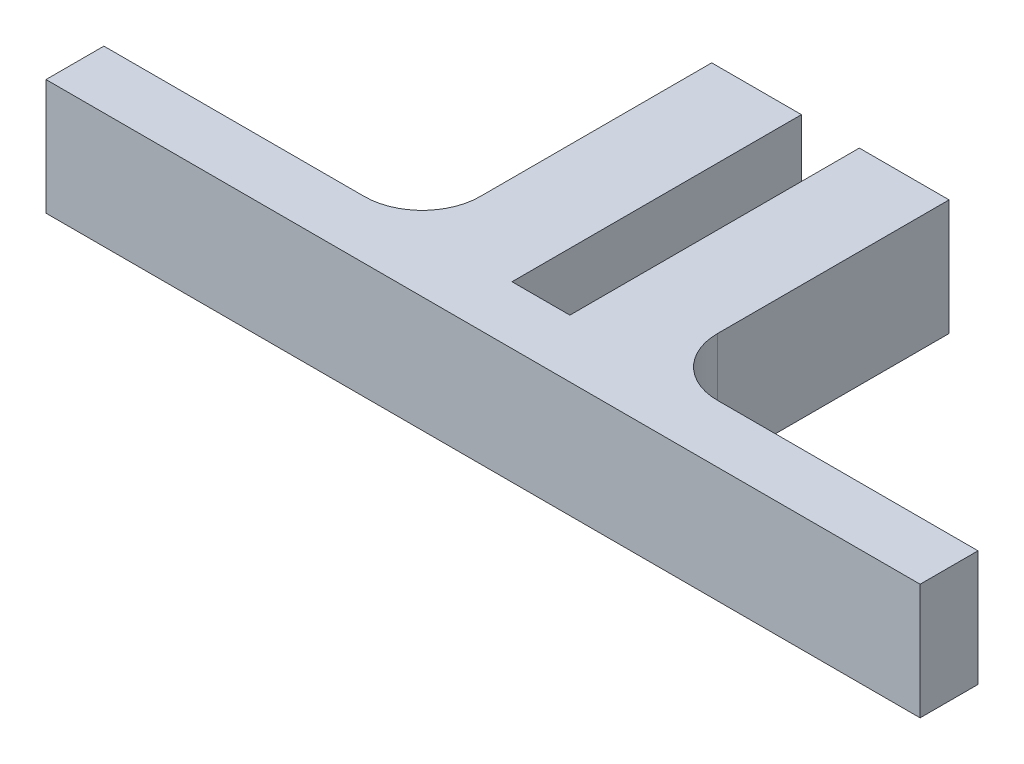
ISO-10303-21;
HEADER;
FILE_DESCRIPTION(('STEP AP214'),'2;1');
FILE_NAME('part.step','',(''),(''),'','','');
FILE_SCHEMA(('AUTOMOTIVE_DESIGN { 1 0 10303 214 1 1 1 1 }'));
ENDSEC;
DATA;
#1=APPLICATION_CONTEXT('core data for automotive mechanical design processes');
#2=APPLICATION_PROTOCOL_DEFINITION('international standard','automotive_design',2000,#1);
#3=PRODUCT_CONTEXT('',#1,'mechanical');
#4=PRODUCT('Part','Part','',(#3));
#5=PRODUCT_RELATED_PRODUCT_CATEGORY('part','',(#4));
#6=PRODUCT_DEFINITION_FORMATION('','',#4);
#7=PRODUCT_DEFINITION_CONTEXT('part definition',#1,'design');
#8=PRODUCT_DEFINITION('design','',#6,#7);
#9=PRODUCT_DEFINITION_SHAPE('','',#8);
#10=(LENGTH_UNIT() NAMED_UNIT(*) SI_UNIT(.MILLI.,.METRE.));
#11=(NAMED_UNIT(*) PLANE_ANGLE_UNIT() SI_UNIT($,.RADIAN.));
#12=(NAMED_UNIT(*) SI_UNIT($,.STERADIAN.) SOLID_ANGLE_UNIT());
#13=UNCERTAINTY_MEASURE_WITH_UNIT(LENGTH_MEASURE(1.E-05),#10,'distance_accuracy_value','');
#14=(GEOMETRIC_REPRESENTATION_CONTEXT(3) GLOBAL_UNCERTAINTY_ASSIGNED_CONTEXT((#13)) GLOBAL_UNIT_ASSIGNED_CONTEXT((#10,
#11,#12)) REPRESENTATION_CONTEXT('',''));
#15=CARTESIAN_POINT('',(0.,0.,0.));
#16=DIRECTION('',(0.,0.,1.));
#17=DIRECTION('',(1.,0.,0.));
#18=AXIS2_PLACEMENT_3D('',#15,#16,#17);
#19=CARTESIAN_POINT('',(15.3033459104335,20.,-102.020345879892));
#20=DIRECTION('',(0.,0.,1.));
#21=DIRECTION('',(1.,0.,0.));
#22=AXIS2_PLACEMENT_3D('',#19,#20,#21);
#23=PLANE('',#22);
#24=DIRECTION('',(0.,1.,0.));
#25=VECTOR('',#24,1.);
#26=CARTESIAN_POINT('',(-0.196654089566506,0.,-102.020345879892));
#27=LINE('',#26,#25);
#28=CARTESIAN_POINT('',(-0.196654089566506,0.,-102.020345879892));
#29=VERTEX_POINT('',#28);
#30=CARTESIAN_POINT('',(-0.196654089566506,20.,-102.020345879892));
#31=VERTEX_POINT('',#30);
#32=EDGE_CURVE('E272',#29,#31,#27,.T.);
#33=ORIENTED_EDGE('',*,*,#32,.T.);
#34=DIRECTION('',(-1.,0.,0.));
#35=VECTOR('',#34,1.);
#36=CARTESIAN_POINT('',(15.3033459104335,20.,-102.020345879892));
#37=LINE('',#36,#35);
#38=CARTESIAN_POINT('',(15.3033459104335,20.,-102.020345879892));
#39=VERTEX_POINT('',#38);
#40=EDGE_CURVE('E147',#39,#31,#37,.T.);
#41=ORIENTED_EDGE('',*,*,#40,.F.);
#42=DIRECTION('',(0.,-1.,0.));
#43=VECTOR('',#42,1.);
#44=CARTESIAN_POINT('',(15.3033459104335,20.,-102.020345879892));
#45=LINE('',#44,#43);
#46=CARTESIAN_POINT('',(15.3033459104335,0.,-102.020345879892));
#47=VERTEX_POINT('',#46);
#48=EDGE_CURVE('E207',#39,#47,#45,.T.);
#49=ORIENTED_EDGE('',*,*,#48,.T.);
#50=DIRECTION('',(-1.,0.,0.));
#51=VECTOR('',#50,1.);
#52=CARTESIAN_POINT('',(15.3033459104335,0.,-102.020345879892));
#53=LINE('',#52,#51);
#54=EDGE_CURVE('E189',#47,#29,#53,.T.);
#55=ORIENTED_EDGE('',*,*,#54,.T.);
#56=EDGE_LOOP('',(#33,#41,#49,#55));
#57=FACE_BOUND('',#56,.T.);
#58=ADVANCED_FACE('F39',(#57),#23,.F.);
#59=CARTESIAN_POINT('',(-80.6966540895665,20.,-52.0203458798924));
#60=DIRECTION('',(1.,0.,0.));
#61=DIRECTION('',(0.,0.,-1.));
#62=AXIS2_PLACEMENT_3D('',#59,#60,#61);
#63=PLANE('',#62);
#64=DIRECTION('',(0.,0.,1.));
#65=VECTOR('',#64,1.);
#66=CARTESIAN_POINT('',(-80.6966540895665,0.,-52.0203458798924));
#67=LINE('',#66,#65);
#68=CARTESIAN_POINT('',(-80.6966540895665,0.,-52.0203458798924));
#69=VERTEX_POINT('',#68);
#70=CARTESIAN_POINT('',(-80.6966540895665,0.,-42.0203458798924));
#71=VERTEX_POINT('',#70);
#72=EDGE_CURVE('E168',#69,#71,#67,.T.);
#73=ORIENTED_EDGE('',*,*,#72,.T.);
#74=DIRECTION('',(0.,-1.,0.));
#75=VECTOR('',#74,1.);
#76=CARTESIAN_POINT('',(-80.6966540895665,20.,-42.0203458798924));
#77=LINE('',#76,#75);
#78=CARTESIAN_POINT('',(-80.6966540895665,20.,-42.0203458798924));
#79=VERTEX_POINT('',#78);
#80=EDGE_CURVE('E11',#79,#71,#77,.T.);
#81=ORIENTED_EDGE('',*,*,#80,.F.);
#82=DIRECTION('',(0.,0.,1.));
#83=VECTOR('',#82,1.);
#84=CARTESIAN_POINT('',(-80.6966540895665,20.,-52.0203458798924));
#85=LINE('',#84,#83);
#86=CARTESIAN_POINT('',(-80.6966540895665,20.,-52.0203458798924));
#87=VERTEX_POINT('',#86);
#88=EDGE_CURVE('E200',#87,#79,#85,.T.);
#89=ORIENTED_EDGE('',*,*,#88,.F.);
#90=DIRECTION('',(0.,-1.,0.));
#91=VECTOR('',#90,1.);
#92=CARTESIAN_POINT('',(-80.6966540895665,20.,-52.0203458798924));
#93=LINE('',#92,#91);
#94=EDGE_CURVE('E164',#87,#69,#93,.T.);
#95=ORIENTED_EDGE('',*,*,#94,.T.);
#96=EDGE_LOOP('',(#73,#81,#89,#95));
#97=FACE_BOUND('',#96,.T.);
#98=ADVANCED_FACE('F41',(#97),#63,.F.);
#99=CARTESIAN_POINT('',(-80.6966540895665,20.,-42.0203458798924));
#100=DIRECTION('',(0.,0.,-1.));
#101=DIRECTION('',(-1.,0.,0.));
#102=AXIS2_PLACEMENT_3D('',#99,#100,#101);
#103=PLANE('',#102);
#104=DIRECTION('',(1.,0.,0.));
#105=VECTOR('',#104,1.);
#106=CARTESIAN_POINT('',(-80.6966540895665,0.,-42.0203458798924));
#107=LINE('',#106,#105);
#108=CARTESIAN_POINT('',(70.3033459104335,0.,-42.0203458798924));
#109=VERTEX_POINT('',#108);
#110=EDGE_CURVE('E172',#71,#109,#107,.T.);
#111=ORIENTED_EDGE('',*,*,#110,.T.);
#112=DIRECTION('',(0.,-1.,0.));
#113=VECTOR('',#112,1.);
#114=CARTESIAN_POINT('',(70.3033459104335,20.,-42.0203458798924));
#115=LINE('',#114,#113);
#116=CARTESIAN_POINT('',(70.3033459104335,20.,-42.0203458798924));
#117=VERTEX_POINT('',#116);
#118=EDGE_CURVE('E48',#117,#109,#115,.T.);
#119=ORIENTED_EDGE('',*,*,#118,.F.);
#120=DIRECTION('',(1.,0.,0.));
#121=VECTOR('',#120,1.);
#122=CARTESIAN_POINT('',(-80.6966540895665,20.,-42.0203458798924));
#123=LINE('',#122,#121);
#124=EDGE_CURVE('E111',#79,#117,#123,.T.);
#125=ORIENTED_EDGE('',*,*,#124,.F.);
#126=ORIENTED_EDGE('',*,*,#80,.T.);
#127=EDGE_LOOP('',(#111,#119,#125,#126));
#128=FACE_BOUND('',#127,.T.);
#129=ADVANCED_FACE('F304',(#128),#103,.F.);
#130=CARTESIAN_POINT('',(70.3033459104335,20.,-52.0203458798924));
#131=DIRECTION('',(-1.,0.,0.));
#132=DIRECTION('',(0.,0.,1.));
#133=AXIS2_PLACEMENT_3D('',#130,#131,#132);
#134=PLANE('',#133);
#135=DIRECTION('',(0.,0.,-1.));
#136=VECTOR('',#135,1.);
#137=CARTESIAN_POINT('',(70.3033459104335,0.,-52.0203458798924));
#138=LINE('',#137,#136);
#139=CARTESIAN_POINT('',(70.3033459104335,0.,-52.0203458798924));
#140=VERTEX_POINT('',#139);
#141=EDGE_CURVE('E176',#109,#140,#138,.T.);
#142=ORIENTED_EDGE('',*,*,#141,.T.);
#143=DIRECTION('',(0.,-1.,0.));
#144=VECTOR('',#143,1.);
#145=CARTESIAN_POINT('',(70.3033459104335,20.,-52.0203458798924));
#146=LINE('',#145,#144);
#147=CARTESIAN_POINT('',(70.3033459104335,20.,-52.0203458798924));
#148=VERTEX_POINT('',#147);
#149=EDGE_CURVE('E219',#148,#140,#146,.T.);
#150=ORIENTED_EDGE('',*,*,#149,.F.);
#151=DIRECTION('',(0.,0.,-1.));
#152=VECTOR('',#151,1.);
#153=CARTESIAN_POINT('',(70.3033459104335,20.,-52.0203458798924));
#154=LINE('',#153,#152);
#155=EDGE_CURVE('E229',#117,#148,#154,.T.);
#156=ORIENTED_EDGE('',*,*,#155,.F.);
#157=ORIENTED_EDGE('',*,*,#118,.T.);
#158=EDGE_LOOP('',(#142,#150,#156,#157));
#159=FACE_BOUND('',#158,.T.);
#160=ADVANCED_FACE('F227',(#159),#134,.F.);
#161=CARTESIAN_POINT('',(25.3033459104336,20.,-52.0203458798924));
#162=DIRECTION('',(0.,0.,1.));
#163=DIRECTION('',(1.,0.,0.));
#164=AXIS2_PLACEMENT_3D('',#161,#162,#163);
#165=PLANE('',#164);
#166=DIRECTION('',(-1.,0.,0.));
#167=VECTOR('',#166,1.);
#168=CARTESIAN_POINT('',(25.3033459104336,0.,-52.0203458798924));
#169=LINE('',#168,#167);
#170=CARTESIAN_POINT('',(25.3033459104336,0.,-52.0203458798924));
#171=VERTEX_POINT('',#170);
#172=EDGE_CURVE('E179',#140,#171,#169,.T.);
#173=ORIENTED_EDGE('',*,*,#172,.T.);
#174=DIRECTION('',(0.,-1.,0.));
#175=VECTOR('',#174,1.);
#176=CARTESIAN_POINT('',(25.3033459104336,20.,-52.0203458798924));
#177=LINE('',#176,#175);
#178=CARTESIAN_POINT('',(25.3033459104336,20.,-52.0203458798924));
#179=VERTEX_POINT('',#178);
#180=EDGE_CURVE('E215',#179,#171,#177,.T.);
#181=ORIENTED_EDGE('',*,*,#180,.F.);
#182=DIRECTION('',(-1.,0.,0.));
#183=VECTOR('',#182,1.);
#184=CARTESIAN_POINT('',(25.3033459104336,20.,-52.0203458798924));
#185=LINE('',#184,#183);
#186=EDGE_CURVE('E249',#148,#179,#185,.T.);
#187=ORIENTED_EDGE('',*,*,#186,.F.);
#188=ORIENTED_EDGE('',*,*,#149,.T.);
#189=EDGE_LOOP('',(#173,#181,#187,#188));
#190=FACE_BOUND('',#189,.T.);
#191=ADVANCED_FACE('F239',(#190),#165,.F.);
#192=CARTESIAN_POINT('',(25.3033459104335,20.,-62.0203458798924));
#193=DIRECTION('',(0.,-1.,0.));
#194=DIRECTION('',(0.,0.,-1.));
#195=AXIS2_PLACEMENT_3D('',#192,#193,#194);
#196=CYLINDRICAL_SURFACE('',#195,10.);
#197=CARTESIAN_POINT('',(25.3033459104335,0.,-62.0203458798924));
#198=DIRECTION('',(0.,-1.,0.));
#199=DIRECTION('',(0.,0.,-1.));
#200=AXIS2_PLACEMENT_3D('',#197,#198,#199);
#201=CIRCLE('',#200,10.);
#202=CARTESIAN_POINT('',(15.3033459104335,0.,-62.0203458798924));
#203=VERTEX_POINT('',#202);
#204=EDGE_CURVE('E182',#171,#203,#201,.T.);
#205=ORIENTED_EDGE('',*,*,#204,.T.);
#206=DIRECTION('',(0.,-1.,0.));
#207=VECTOR('',#206,1.);
#208=CARTESIAN_POINT('',(15.3033459104335,20.,-62.0203458798924));
#209=LINE('',#208,#207);
#210=CARTESIAN_POINT('',(15.3033459104335,20.,-62.0203458798924));
#211=VERTEX_POINT('',#210);
#212=EDGE_CURVE('E211',#211,#203,#209,.T.);
#213=ORIENTED_EDGE('',*,*,#212,.F.);
#214=CARTESIAN_POINT('',(25.3033459104335,20.,-62.0203458798924));
#215=DIRECTION('',(0.,-1.,0.));
#216=DIRECTION('',(0.,0.,-1.));
#217=AXIS2_PLACEMENT_3D('',#214,#215,#216);
#218=CIRCLE('',#217,10.);
#219=EDGE_CURVE('E245',#179,#211,#218,.T.);
#220=ORIENTED_EDGE('',*,*,#219,.F.);
#221=ORIENTED_EDGE('',*,*,#180,.T.);
#222=EDGE_LOOP('',(#205,#213,#220,#221));
#223=FACE_BOUND('',#222,.T.);
#224=ADVANCED_FACE('F243',(#223),#196,.F.);
#225=CARTESIAN_POINT('',(15.3033459104335,20.,-102.020345879892));
#226=DIRECTION('',(-1.,0.,0.));
#227=DIRECTION('',(0.,0.,1.));
#228=AXIS2_PLACEMENT_3D('',#225,#226,#227);
#229=PLANE('',#228);
#230=DIRECTION('',(0.,0.,-1.));
#231=VECTOR('',#230,1.);
#232=CARTESIAN_POINT('',(15.3033459104335,0.,-102.020345879892));
#233=LINE('',#232,#231);
#234=EDGE_CURVE('E185',#203,#47,#233,.T.);
#235=ORIENTED_EDGE('',*,*,#234,.T.);
#236=ORIENTED_EDGE('',*,*,#48,.F.);
#237=DIRECTION('',(0.,0.,-1.));
#238=VECTOR('',#237,1.);
#239=CARTESIAN_POINT('',(15.3033459104335,20.,-102.020345879892));
#240=LINE('',#239,#238);
#241=EDGE_CURVE('E248',#211,#39,#240,.T.);
#242=ORIENTED_EDGE('',*,*,#241,.F.);
#243=ORIENTED_EDGE('',*,*,#212,.T.);
#244=EDGE_LOOP('',(#235,#236,#242,#243));
#245=FACE_BOUND('',#244,.T.);
#246=ADVANCED_FACE('F319',(#245),#229,.F.);
#247=CARTESIAN_POINT('',(-10.1966540895665,20.,-102.020345879892));
#248=VERTEX_POINT('',#247);
#249=CARTESIAN_POINT('',(-25.6966540895665,20.,-102.020345879892));
#250=VERTEX_POINT('',#249);
#251=EDGE_CURVE('E142',#248,#250,#37,.T.);
#252=ORIENTED_EDGE('',*,*,#251,.F.);
#253=DIRECTION('',(0.,1.,0.));
#254=VECTOR('',#253,1.);
#255=CARTESIAN_POINT('',(-10.1966540895665,0.,-102.020345879892));
#256=LINE('',#255,#254);
#257=CARTESIAN_POINT('',(-10.1966540895665,0.,-102.020345879892));
#258=VERTEX_POINT('',#257);
#259=EDGE_CURVE('E276',#258,#248,#256,.T.);
#260=ORIENTED_EDGE('',*,*,#259,.F.);
#261=CARTESIAN_POINT('',(-25.6966540895665,0.,-102.020345879892));
#262=VERTEX_POINT('',#261);
#263=EDGE_CURVE('E188',#258,#262,#53,.T.);
#264=ORIENTED_EDGE('',*,*,#263,.T.);
#265=DIRECTION('',(0.,-1.,0.));
#266=VECTOR('',#265,1.);
#267=CARTESIAN_POINT('',(-25.6966540895665,20.,-102.020345879892));
#268=LINE('',#267,#266);
#269=EDGE_CURVE('E157',#250,#262,#268,.T.);
#270=ORIENTED_EDGE('',*,*,#269,.F.);
#271=EDGE_LOOP('',(#252,#260,#264,#270));
#272=FACE_BOUND('',#271,.T.);
#273=ADVANCED_FACE('F313',(#272),#23,.F.);
#274=CARTESIAN_POINT('',(-25.6966540895665,20.,-102.020345879892));
#275=DIRECTION('',(1.,0.,0.));
#276=DIRECTION('',(0.,0.,-1.));
#277=AXIS2_PLACEMENT_3D('',#274,#275,#276);
#278=PLANE('',#277);
#279=DIRECTION('',(0.,0.,1.));
#280=VECTOR('',#279,1.);
#281=CARTESIAN_POINT('',(-25.6966540895665,0.,-102.020345879892));
#282=LINE('',#281,#280);
#283=CARTESIAN_POINT('',(-25.6966540895665,0.,-62.0203458798925));
#284=VERTEX_POINT('',#283);
#285=EDGE_CURVE('E153',#262,#284,#282,.T.);
#286=ORIENTED_EDGE('',*,*,#285,.T.);
#287=DIRECTION('',(0.,-1.,0.));
#288=VECTOR('',#287,1.);
#289=CARTESIAN_POINT('',(-25.6966540895665,20.,-62.0203458798925));
#290=LINE('',#289,#288);
#291=CARTESIAN_POINT('',(-25.6966540895665,20.,-62.0203458798925));
#292=VERTEX_POINT('',#291);
#293=EDGE_CURVE('E150',#292,#284,#290,.T.);
#294=ORIENTED_EDGE('',*,*,#293,.F.);
#295=DIRECTION('',(0.,0.,1.));
#296=VECTOR('',#295,1.);
#297=CARTESIAN_POINT('',(-25.6966540895665,20.,-102.020345879892));
#298=LINE('',#297,#296);
#299=EDGE_CURVE('E133',#250,#292,#298,.T.);
#300=ORIENTED_EDGE('',*,*,#299,.F.);
#301=ORIENTED_EDGE('',*,*,#269,.T.);
#302=EDGE_LOOP('',(#286,#294,#300,#301));
#303=FACE_BOUND('',#302,.T.);
#304=ADVANCED_FACE('F151',(#303),#278,.F.);
#305=CARTESIAN_POINT('',(-35.6966540895665,20.,-62.0203458798924));
#306=DIRECTION('',(0.,-1.,0.));
#307=DIRECTION('',(0.,0.,-1.));
#308=AXIS2_PLACEMENT_3D('',#305,#306,#307);
#309=CYLINDRICAL_SURFACE('',#308,10.);
#310=CARTESIAN_POINT('',(-35.6966540895665,0.,-62.0203458798924));
#311=DIRECTION('',(0.,-1.,0.));
#312=DIRECTION('',(0.,0.,1.));
#313=AXIS2_PLACEMENT_3D('',#310,#311,#312);
#314=CIRCLE('',#313,10.);
#315=CARTESIAN_POINT('',(-35.6966540895666,0.,-52.0203458798924));
#316=VERTEX_POINT('',#315);
#317=EDGE_CURVE('E195',#284,#316,#314,.T.);
#318=ORIENTED_EDGE('',*,*,#317,.T.);
#319=DIRECTION('',(0.,-1.,0.));
#320=VECTOR('',#319,1.);
#321=CARTESIAN_POINT('',(-35.6966540895666,20.,-52.0203458798924));
#322=LINE('',#321,#320);
#323=CARTESIAN_POINT('',(-35.6966540895666,20.,-52.0203458798924));
#324=VERTEX_POINT('',#323);
#325=EDGE_CURVE('E158',#324,#316,#322,.T.);
#326=ORIENTED_EDGE('',*,*,#325,.F.);
#327=CARTESIAN_POINT('',(-35.6966540895665,20.,-62.0203458798924));
#328=DIRECTION('',(0.,-1.,0.));
#329=DIRECTION('',(0.,0.,1.));
#330=AXIS2_PLACEMENT_3D('',#327,#328,#329);
#331=CIRCLE('',#330,10.);
#332=EDGE_CURVE('E138',#292,#324,#331,.T.);
#333=ORIENTED_EDGE('',*,*,#332,.F.);
#334=ORIENTED_EDGE('',*,*,#293,.T.);
#335=EDGE_LOOP('',(#318,#326,#333,#334));
#336=FACE_BOUND('',#335,.T.);
#337=ADVANCED_FACE('F160',(#336),#309,.F.);
#338=CARTESIAN_POINT('',(-80.6966540895665,20.,-52.0203458798924));
#339=DIRECTION('',(0.,0.,1.));
#340=DIRECTION('',(1.,0.,0.));
#341=AXIS2_PLACEMENT_3D('',#338,#339,#340);
#342=PLANE('',#341);
#343=DIRECTION('',(-1.,0.,0.));
#344=VECTOR('',#343,1.);
#345=CARTESIAN_POINT('',(-80.6966540895665,0.,-52.0203458798924));
#346=LINE('',#345,#344);
#347=EDGE_CURVE('E103',#316,#69,#346,.T.);
#348=ORIENTED_EDGE('',*,*,#347,.T.);
#349=ORIENTED_EDGE('',*,*,#94,.F.);
#350=DIRECTION('',(-1.,0.,0.));
#351=VECTOR('',#350,1.);
#352=CARTESIAN_POINT('',(-80.6966540895665,20.,-52.0203458798924));
#353=LINE('',#352,#351);
#354=EDGE_CURVE('E64',#324,#87,#353,.T.);
#355=ORIENTED_EDGE('',*,*,#354,.F.);
#356=ORIENTED_EDGE('',*,*,#325,.T.);
#357=EDGE_LOOP('',(#348,#349,#355,#356));
#358=FACE_BOUND('',#357,.T.);
#359=ADVANCED_FACE('F361',(#358),#342,.F.);
#360=CARTESIAN_POINT('',(25.3033459104335,20.,-62.0203458798924));
#361=DIRECTION('',(0.,-1.,0.));
#362=DIRECTION('',(0.,0.,-1.));
#363=AXIS2_PLACEMENT_3D('',#360,#361,#362);
#364=PLANE('',#363);
#365=DIRECTION('',(1.,0.,0.));
#366=VECTOR('',#365,1.);
#367=CARTESIAN_POINT('',(-10.1966540895665,20.,-52.0203458798924));
#368=LINE('',#367,#366);
#369=CARTESIAN_POINT('',(-10.1966540895665,20.,-52.0203458798924));
#370=VERTEX_POINT('',#369);
#371=CARTESIAN_POINT('',(-0.196654089566506,20.,-52.0203458798924));
#372=VERTEX_POINT('',#371);
#373=EDGE_CURVE('E280',#370,#372,#368,.T.);
#374=ORIENTED_EDGE('',*,*,#373,.F.);
#375=DIRECTION('',(0.,0.,-1.));
#376=VECTOR('',#375,1.);
#377=CARTESIAN_POINT('',(-10.1966540895665,20.,-52.0203458798924));
#378=LINE('',#377,#376);
#379=EDGE_CURVE('E173',#370,#248,#378,.T.);
#380=ORIENTED_EDGE('',*,*,#379,.T.);
#381=ORIENTED_EDGE('',*,*,#251,.T.);
#382=ORIENTED_EDGE('',*,*,#299,.T.);
#383=ORIENTED_EDGE('',*,*,#332,.T.);
#384=ORIENTED_EDGE('',*,*,#354,.T.);
#385=ORIENTED_EDGE('',*,*,#88,.T.);
#386=ORIENTED_EDGE('',*,*,#124,.T.);
#387=ORIENTED_EDGE('',*,*,#155,.T.);
#388=ORIENTED_EDGE('',*,*,#186,.T.);
#389=ORIENTED_EDGE('',*,*,#219,.T.);
#390=ORIENTED_EDGE('',*,*,#241,.T.);
#391=ORIENTED_EDGE('',*,*,#40,.T.);
#392=DIRECTION('',(0.,0.,-1.));
#393=VECTOR('',#392,1.);
#394=CARTESIAN_POINT('',(-0.196654089566506,20.,-52.0203458798924));
#395=LINE('',#394,#393);
#396=EDGE_CURVE('E264',#372,#31,#395,.T.);
#397=ORIENTED_EDGE('',*,*,#396,.F.);
#398=EDGE_LOOP('',(#374,#380,#381,#382,#383,#384,#385,#386,#387,#388,#389,#390,#391,#397));
#399=FACE_BOUND('',#398,.T.);
#400=ADVANCED_FACE('F136',(#399),#364,.F.);
#401=CARTESIAN_POINT('',(25.3033459104335,0.,-62.0203458798924));
#402=DIRECTION('',(0.,-1.,0.));
#403=DIRECTION('',(0.,0.,-1.));
#404=AXIS2_PLACEMENT_3D('',#401,#402,#403);
#405=PLANE('',#404);
#406=DIRECTION('',(0.,0.,-1.));
#407=VECTOR('',#406,1.);
#408=CARTESIAN_POINT('',(-10.1966540895665,0.,-52.0203458798924));
#409=LINE('',#408,#407);
#410=CARTESIAN_POINT('',(-10.1966540895665,0.,-52.0203458798924));
#411=VERTEX_POINT('',#410);
#412=EDGE_CURVE('E288',#411,#258,#409,.T.);
#413=ORIENTED_EDGE('',*,*,#412,.F.);
#414=DIRECTION('',(1.,0.,0.));
#415=VECTOR('',#414,1.);
#416=CARTESIAN_POINT('',(-10.1966540895665,0.,-52.0203458798924));
#417=LINE('',#416,#415);
#418=CARTESIAN_POINT('',(-0.196654089566508,0.,-52.0203458798924));
#419=VERTEX_POINT('',#418);
#420=EDGE_CURVE('E339',#411,#419,#417,.T.);
#421=ORIENTED_EDGE('',*,*,#420,.T.);
#422=DIRECTION('',(0.,0.,-1.));
#423=VECTOR('',#422,1.);
#424=CARTESIAN_POINT('',(-0.196654089566506,0.,-52.0203458798924));
#425=LINE('',#424,#423);
#426=EDGE_CURVE('E292',#419,#29,#425,.T.);
#427=ORIENTED_EDGE('',*,*,#426,.T.);
#428=ORIENTED_EDGE('',*,*,#54,.F.);
#429=ORIENTED_EDGE('',*,*,#234,.F.);
#430=ORIENTED_EDGE('',*,*,#204,.F.);
#431=ORIENTED_EDGE('',*,*,#172,.F.);
#432=ORIENTED_EDGE('',*,*,#141,.F.);
#433=ORIENTED_EDGE('',*,*,#110,.F.);
#434=ORIENTED_EDGE('',*,*,#72,.F.);
#435=ORIENTED_EDGE('',*,*,#347,.F.);
#436=ORIENTED_EDGE('',*,*,#317,.F.);
#437=ORIENTED_EDGE('',*,*,#285,.F.);
#438=ORIENTED_EDGE('',*,*,#263,.F.);
#439=EDGE_LOOP('',(#413,#421,#427,#428,#429,#430,#431,#432,#433,#434,#435,#436,#437,#438));
#440=FACE_BOUND('',#439,.T.);
#441=ADVANCED_FACE('F233',(#440),#405,.T.);
#442=CARTESIAN_POINT('',(-10.1966540895665,0.,-52.0203458798924));
#443=DIRECTION('',(-1.,0.,0.));
#444=DIRECTION('',(0.,0.,1.));
#445=AXIS2_PLACEMENT_3D('',#442,#443,#444);
#446=PLANE('',#445);
#447=ORIENTED_EDGE('',*,*,#259,.T.);
#448=ORIENTED_EDGE('',*,*,#379,.F.);
#449=DIRECTION('',(0.,1.,0.));
#450=VECTOR('',#449,1.);
#451=CARTESIAN_POINT('',(-10.1966540895665,0.,-52.0203458798924));
#452=LINE('',#451,#450);
#453=EDGE_CURVE('E283',#411,#370,#452,.T.);
#454=ORIENTED_EDGE('',*,*,#453,.F.);
#455=ORIENTED_EDGE('',*,*,#412,.T.);
#456=EDGE_LOOP('',(#447,#448,#454,#455));
#457=FACE_BOUND('',#456,.T.);
#458=ADVANCED_FACE('F342',(#457),#446,.F.);
#459=CARTESIAN_POINT('',(-0.196654089566506,0.,-52.0203458798924));
#460=DIRECTION('',(-1.,0.,0.));
#461=DIRECTION('',(0.,0.,1.));
#462=AXIS2_PLACEMENT_3D('',#459,#460,#461);
#463=PLANE('',#462);
#464=ORIENTED_EDGE('',*,*,#32,.F.);
#465=ORIENTED_EDGE('',*,*,#426,.F.);
#466=DIRECTION('',(0.,1.,0.));
#467=VECTOR('',#466,1.);
#468=CARTESIAN_POINT('',(-0.196654089566506,0.,-52.0203458798924));
#469=LINE('',#468,#467);
#470=EDGE_CURVE('E55',#419,#372,#469,.T.);
#471=ORIENTED_EDGE('',*,*,#470,.T.);
#472=ORIENTED_EDGE('',*,*,#396,.T.);
#473=EDGE_LOOP('',(#464,#465,#471,#472));
#474=FACE_BOUND('',#473,.T.);
#475=ADVANCED_FACE('F349',(#474),#463,.T.);
#476=CARTESIAN_POINT('',(0.,0.,-52.0203458798924));
#477=DIRECTION('',(0.,0.,1.));
#478=DIRECTION('',(1.,0.,0.));
#479=AXIS2_PLACEMENT_3D('',#476,#477,#478);
#480=PLANE('',#479);
#481=ORIENTED_EDGE('',*,*,#373,.T.);
#482=ORIENTED_EDGE('',*,*,#470,.F.);
#483=ORIENTED_EDGE('',*,*,#420,.F.);
#484=ORIENTED_EDGE('',*,*,#453,.T.);
#485=EDGE_LOOP('',(#481,#482,#483,#484));
#486=FACE_BOUND('',#485,.T.);
#487=ADVANCED_FACE('F340',(#486),#480,.F.);
#488=CLOSED_SHELL('',(#58,#98,#129,#160,#191,#224,#246,#273,#304,#337,#359,#400,#441,#458,#475,#487));
#489=MANIFOLD_SOLID_BREP('B2',#488);
#490=ADVANCED_BREP_SHAPE_REPRESENTATION('',(#18,#489),#14);
#491=SHAPE_DEFINITION_REPRESENTATION(#9,#490);
ENDSEC;
END-ISO-10303-21;
